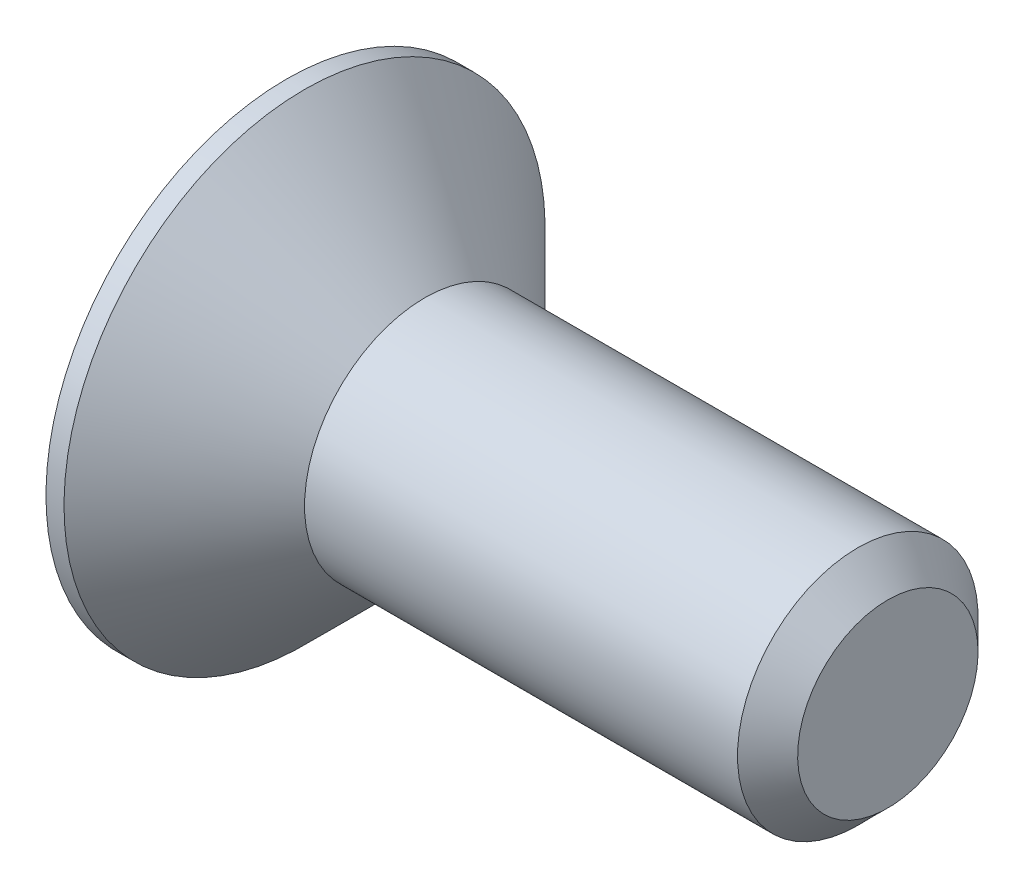
ISO-10303-21;
HEADER;
FILE_DESCRIPTION(('STEP AP214'),'2;1');
FILE_NAME('part.step','',(''),(''),'','','');
FILE_SCHEMA(('AUTOMOTIVE_DESIGN { 1 0 10303 214 1 1 1 1 }'));
ENDSEC;
DATA;
#1=APPLICATION_CONTEXT('core data for automotive mechanical design processes');
#2=APPLICATION_PROTOCOL_DEFINITION('international standard','automotive_design',2000,#1);
#3=PRODUCT_CONTEXT('',#1,'mechanical');
#4=PRODUCT('Part','Part','',(#3));
#5=PRODUCT_RELATED_PRODUCT_CATEGORY('part','',(#4));
#6=PRODUCT_DEFINITION_FORMATION('','',#4);
#7=PRODUCT_DEFINITION_CONTEXT('part definition',#1,'design');
#8=PRODUCT_DEFINITION('design','',#6,#7);
#9=PRODUCT_DEFINITION_SHAPE('','',#8);
#10=(LENGTH_UNIT() NAMED_UNIT(*) SI_UNIT(.MILLI.,.METRE.));
#11=(NAMED_UNIT(*) PLANE_ANGLE_UNIT() SI_UNIT($,.RADIAN.));
#12=(NAMED_UNIT(*) SI_UNIT($,.STERADIAN.) SOLID_ANGLE_UNIT());
#13=UNCERTAINTY_MEASURE_WITH_UNIT(LENGTH_MEASURE(1.E-05),#10,'distance_accuracy_value','');
#14=(GEOMETRIC_REPRESENTATION_CONTEXT(3) GLOBAL_UNCERTAINTY_ASSIGNED_CONTEXT((#13)) GLOBAL_UNIT_ASSIGNED_CONTEXT((#10,
#11,#12)) REPRESENTATION_CONTEXT('',''));
#15=CARTESIAN_POINT('',(0.,0.,0.));
#16=DIRECTION('',(0.,0.,1.));
#17=DIRECTION('',(1.,0.,0.));
#18=AXIS2_PLACEMENT_3D('',#15,#16,#17);
#19=CARTESIAN_POINT('',(0.,0.,0.));
#20=DIRECTION('',(-1.,0.,0.));
#21=DIRECTION('',(0.,-1.,0.));
#22=AXIS2_PLACEMENT_3D('',#19,#20,#21);
#23=PLANE('',#22);
#24=DIRECTION('',(0.,0.5,-0.866025403784439));
#25=VECTOR('',#24,1.);
#26=CARTESIAN_POINT('',(0.,0.721687836487033,1.25));
#27=LINE('',#26,#25);
#28=CARTESIAN_POINT('',(0.,0.721687836487033,1.25));
#29=VERTEX_POINT('',#28);
#30=CARTESIAN_POINT('',(0.,1.44337567297406,0.));
#31=VERTEX_POINT('',#30);
#32=EDGE_CURVE('E48',#29,#31,#27,.T.);
#33=ORIENTED_EDGE('',*,*,#32,.F.);
#34=DIRECTION('',(0.,1.,0.));
#35=VECTOR('',#34,1.);
#36=CARTESIAN_POINT('',(0.,-0.721687836487033,1.25));
#37=LINE('',#36,#35);
#38=CARTESIAN_POINT('',(0.,-0.721687836487033,1.25));
#39=VERTEX_POINT('',#38);
#40=EDGE_CURVE('E131',#39,#29,#37,.T.);
#41=ORIENTED_EDGE('',*,*,#40,.F.);
#42=DIRECTION('',(0.,0.5,0.866025403784439));
#43=VECTOR('',#42,1.);
#44=CARTESIAN_POINT('',(0.,-1.44337567297406,0.));
#45=LINE('',#44,#43);
#46=CARTESIAN_POINT('',(0.,-1.44337567297406,0.));
#47=VERTEX_POINT('',#46);
#48=EDGE_CURVE('E129',#47,#39,#45,.T.);
#49=ORIENTED_EDGE('',*,*,#48,.F.);
#50=DIRECTION('',(0.,-0.5,0.866025403784439));
#51=VECTOR('',#50,1.);
#52=CARTESIAN_POINT('',(0.,-0.721687836487032,-1.25));
#53=LINE('',#52,#51);
#54=CARTESIAN_POINT('',(0.,-0.721687836487032,-1.25));
#55=VERTEX_POINT('',#54);
#56=EDGE_CURVE('E96',#55,#47,#53,.T.);
#57=ORIENTED_EDGE('',*,*,#56,.F.);
#58=DIRECTION('',(0.,-1.,0.));
#59=VECTOR('',#58,1.);
#60=CARTESIAN_POINT('',(0.,0.721687836487033,-1.25));
#61=LINE('',#60,#59);
#62=CARTESIAN_POINT('',(0.,0.721687836487033,-1.25));
#63=VERTEX_POINT('',#62);
#64=EDGE_CURVE('E125',#63,#55,#61,.T.);
#65=ORIENTED_EDGE('',*,*,#64,.F.);
#66=DIRECTION('',(0.,-0.5,-0.866025403784439));
#67=VECTOR('',#66,1.);
#68=CARTESIAN_POINT('',(0.,1.44337567297406,0.));
#69=LINE('',#68,#67);
#70=EDGE_CURVE('E122',#31,#63,#69,.T.);
#71=ORIENTED_EDGE('',*,*,#70,.F.);
#72=EDGE_LOOP('',(#33,#41,#49,#57,#65,#71));
#73=FACE_BOUND('',#72,.T.);
#74=CARTESIAN_POINT('',(0.,0.,0.));
#75=DIRECTION('',(1.,0.,0.));
#76=DIRECTION('',(0.,1.,0.));
#77=AXIS2_PLACEMENT_3D('',#74,#75,#76);
#78=CIRCLE('',#77,4.);
#79=CARTESIAN_POINT('',(0.,4.,0.));
#80=VERTEX_POINT('',#79);
#81=EDGE_CURVE('E146',#80,#80,#78,.T.);
#82=ORIENTED_EDGE('',*,*,#81,.F.);
#83=EDGE_LOOP('',(#82));
#84=FACE_BOUND('',#83,.T.);
#85=ADVANCED_FACE('F33',(#73,#84),#23,.T.);
#86=CARTESIAN_POINT('',(10.,0.,0.));
#87=DIRECTION('',(1.,0.,0.));
#88=DIRECTION('',(0.,1.,0.));
#89=AXIS2_PLACEMENT_3D('',#86,#87,#88);
#90=CYLINDRICAL_SURFACE('',#89,4.);
#91=ORIENTED_EDGE('',*,*,#81,.T.);
#92=EDGE_LOOP('',(#91));
#93=FACE_BOUND('',#92,.T.);
#94=CARTESIAN_POINT('',(0.29999999999995,0.,0.));
#95=DIRECTION('',(1.,0.,0.));
#96=DIRECTION('',(0.,1.,0.));
#97=AXIS2_PLACEMENT_3D('',#94,#95,#96);
#98=CIRCLE('',#97,4.);
#99=CARTESIAN_POINT('',(0.299999999999951,4.,0.));
#100=VERTEX_POINT('',#99);
#101=EDGE_CURVE('E143',#100,#100,#98,.T.);
#102=ORIENTED_EDGE('',*,*,#101,.F.);
#103=EDGE_LOOP('',(#102));
#104=FACE_BOUND('',#103,.T.);
#105=ADVANCED_FACE('F166',(#93,#104),#90,.T.);
#106=CARTESIAN_POINT('',(2.3,0.,0.));
#107=DIRECTION('',(-1.,0.,0.));
#108=DIRECTION('',(0.,-1.,0.));
#109=AXIS2_PLACEMENT_3D('',#106,#107,#108);
#110=CONICAL_SURFACE('',#109,2.,0.785398163397436);
#111=ORIENTED_EDGE('',*,*,#101,.T.);
#112=EDGE_LOOP('',(#111));
#113=FACE_BOUND('',#112,.T.);
#114=CARTESIAN_POINT('',(2.3,0.,0.));
#115=DIRECTION('',(1.,0.,0.));
#116=DIRECTION('',(0.,1.,0.));
#117=AXIS2_PLACEMENT_3D('',#114,#115,#116);
#118=CIRCLE('',#117,2.);
#119=CARTESIAN_POINT('',(2.3,2.,0.));
#120=VERTEX_POINT('',#119);
#121=EDGE_CURVE('E135',#120,#120,#118,.T.);
#122=ORIENTED_EDGE('',*,*,#121,.F.);
#123=EDGE_LOOP('',(#122));
#124=FACE_BOUND('',#123,.T.);
#125=ADVANCED_FACE('F171',(#113,#124),#110,.T.);
#126=CARTESIAN_POINT('',(10.,0.,0.));
#127=DIRECTION('',(1.,0.,0.));
#128=DIRECTION('',(0.,1.,0.));
#129=AXIS2_PLACEMENT_3D('',#126,#127,#128);
#130=CYLINDRICAL_SURFACE('',#129,2.);
#131=CARTESIAN_POINT('',(9.5,0.,0.));
#132=DIRECTION('',(1.,0.,0.));
#133=DIRECTION('',(0.,1.,0.));
#134=AXIS2_PLACEMENT_3D('',#131,#132,#133);
#135=CIRCLE('',#134,2.);
#136=CARTESIAN_POINT('',(9.5,2.,0.));
#137=VERTEX_POINT('',#136);
#138=EDGE_CURVE('E11',#137,#137,#135,.F.);
#139=ORIENTED_EDGE('',*,*,#138,.T.);
#140=EDGE_LOOP('',(#139));
#141=FACE_BOUND('',#140,.T.);
#142=ORIENTED_EDGE('',*,*,#121,.T.);
#143=EDGE_LOOP('',(#142));
#144=FACE_BOUND('',#143,.T.);
#145=ADVANCED_FACE('F162',(#141,#144),#130,.T.);
#146=CARTESIAN_POINT('',(10.,2.,0.));
#147=DIRECTION('',(1.,0.,0.));
#148=DIRECTION('',(0.,1.,0.));
#149=AXIS2_PLACEMENT_3D('',#146,#147,#148);
#150=PLANE('',#149);
#151=CARTESIAN_POINT('',(10.,0.,0.));
#152=DIRECTION('',(1.,0.,0.));
#153=DIRECTION('',(0.,1.,0.));
#154=AXIS2_PLACEMENT_3D('',#151,#152,#153);
#155=CIRCLE('',#154,1.5);
#156=CARTESIAN_POINT('',(10.,1.5,0.));
#157=VERTEX_POINT('',#156);
#158=EDGE_CURVE('E41',#157,#157,#155,.T.);
#159=ORIENTED_EDGE('',*,*,#158,.T.);
#160=EDGE_LOOP('',(#159));
#161=FACE_BOUND('',#160,.T.);
#162=ADVANCED_FACE('F151',(#161),#150,.T.);
#163=CARTESIAN_POINT('',(10.,0.,0.));
#164=DIRECTION('',(-1.,0.,0.));
#165=DIRECTION('',(0.,-1.,0.));
#166=AXIS2_PLACEMENT_3D('',#163,#164,#165);
#167=CONICAL_SURFACE('',#166,1.5,0.785398163397446);
#168=ORIENTED_EDGE('',*,*,#138,.F.);
#169=EDGE_LOOP('',(#168));
#170=FACE_BOUND('',#169,.T.);
#171=ORIENTED_EDGE('',*,*,#158,.F.);
#172=EDGE_LOOP('',(#171));
#173=FACE_BOUND('',#172,.T.);
#174=ADVANCED_FACE('F35',(#170,#173),#167,.T.);
#175=CARTESIAN_POINT('',(1.8,0.721687836487032,1.25));
#176=DIRECTION('',(0.,0.866025403784438,0.5));
#177=DIRECTION('',(0.,-0.5,0.866025403784439));
#178=AXIS2_PLACEMENT_3D('',#175,#176,#177);
#179=PLANE('',#178);
#180=ORIENTED_EDGE('',*,*,#32,.T.);
#181=DIRECTION('',(-1.,0.,0.));
#182=VECTOR('',#181,1.);
#183=CARTESIAN_POINT('',(1.8,1.44337567297406,0.));
#184=LINE('',#183,#182);
#185=CARTESIAN_POINT('',(1.8,1.44337567297406,0.));
#186=VERTEX_POINT('',#185);
#187=EDGE_CURVE('E78',#186,#31,#184,.T.);
#188=ORIENTED_EDGE('',*,*,#187,.F.);
#189=DIRECTION('',(0.,0.5,-0.866025403784439));
#190=VECTOR('',#189,1.);
#191=CARTESIAN_POINT('',(1.8,0.721687836487032,1.25));
#192=LINE('',#191,#190);
#193=CARTESIAN_POINT('',(1.8,0.721687836487032,1.25));
#194=VERTEX_POINT('',#193);
#195=EDGE_CURVE('E133',#194,#186,#192,.T.);
#196=ORIENTED_EDGE('',*,*,#195,.F.);
#197=DIRECTION('',(-1.,0.,0.));
#198=VECTOR('',#197,1.);
#199=CARTESIAN_POINT('',(1.8,0.721687836487032,1.25));
#200=LINE('',#199,#198);
#201=EDGE_CURVE('E56',#194,#29,#200,.T.);
#202=ORIENTED_EDGE('',*,*,#201,.T.);
#203=EDGE_LOOP('',(#180,#188,#196,#202));
#204=FACE_BOUND('',#203,.T.);
#205=ADVANCED_FACE('F154',(#204),#179,.F.);
#206=CARTESIAN_POINT('',(1.8,-0.721687836487033,1.25));
#207=DIRECTION('',(0.,0.,1.));
#208=DIRECTION('',(0.,-1.,0.));
#209=AXIS2_PLACEMENT_3D('',#206,#207,#208);
#210=PLANE('',#209);
#211=ORIENTED_EDGE('',*,*,#40,.T.);
#212=ORIENTED_EDGE('',*,*,#201,.F.);
#213=DIRECTION('',(0.,1.,0.));
#214=VECTOR('',#213,1.);
#215=CARTESIAN_POINT('',(1.8,-0.721687836487033,1.25));
#216=LINE('',#215,#214);
#217=CARTESIAN_POINT('',(1.8,-0.721687836487033,1.25));
#218=VERTEX_POINT('',#217);
#219=EDGE_CURVE('E108',#218,#194,#216,.T.);
#220=ORIENTED_EDGE('',*,*,#219,.F.);
#221=DIRECTION('',(-1.,0.,0.));
#222=VECTOR('',#221,1.);
#223=CARTESIAN_POINT('',(1.8,-0.721687836487033,1.25));
#224=LINE('',#223,#222);
#225=EDGE_CURVE('E100',#218,#39,#224,.T.);
#226=ORIENTED_EDGE('',*,*,#225,.T.);
#227=EDGE_LOOP('',(#211,#212,#220,#226));
#228=FACE_BOUND('',#227,.T.);
#229=ADVANCED_FACE('F160',(#228),#210,.F.);
#230=CARTESIAN_POINT('',(1.8,-1.44337567297407,0.));
#231=DIRECTION('',(0.,-0.866025403784439,0.5));
#232=DIRECTION('',(0.,-0.5,-0.866025403784439));
#233=AXIS2_PLACEMENT_3D('',#230,#231,#232);
#234=PLANE('',#233);
#235=ORIENTED_EDGE('',*,*,#48,.T.);
#236=ORIENTED_EDGE('',*,*,#225,.F.);
#237=DIRECTION('',(0.,0.5,0.866025403784439));
#238=VECTOR('',#237,1.);
#239=CARTESIAN_POINT('',(1.8,-1.44337567297407,0.));
#240=LINE('',#239,#238);
#241=CARTESIAN_POINT('',(1.8,-1.44337567297407,0.));
#242=VERTEX_POINT('',#241);
#243=EDGE_CURVE('E104',#242,#218,#240,.T.);
#244=ORIENTED_EDGE('',*,*,#243,.F.);
#245=DIRECTION('',(-1.,0.,0.));
#246=VECTOR('',#245,1.);
#247=CARTESIAN_POINT('',(1.8,-1.44337567297407,0.));
#248=LINE('',#247,#246);
#249=EDGE_CURVE('E89',#242,#47,#248,.T.);
#250=ORIENTED_EDGE('',*,*,#249,.T.);
#251=EDGE_LOOP('',(#235,#236,#244,#250));
#252=FACE_BOUND('',#251,.T.);
#253=ADVANCED_FACE('F105',(#252),#234,.F.);
#254=CARTESIAN_POINT('',(1.8,-0.721687836487033,-1.25));
#255=DIRECTION('',(0.,-0.866025403784438,-0.5));
#256=DIRECTION('',(0.,0.5,-0.866025403784439));
#257=AXIS2_PLACEMENT_3D('',#254,#255,#256);
#258=PLANE('',#257);
#259=ORIENTED_EDGE('',*,*,#56,.T.);
#260=ORIENTED_EDGE('',*,*,#249,.F.);
#261=DIRECTION('',(0.,-0.5,0.866025403784439));
#262=VECTOR('',#261,1.);
#263=CARTESIAN_POINT('',(1.8,-0.721687836487033,-1.25));
#264=LINE('',#263,#262);
#265=CARTESIAN_POINT('',(1.8,-0.721687836487033,-1.25));
#266=VERTEX_POINT('',#265);
#267=EDGE_CURVE('E93',#266,#242,#264,.T.);
#268=ORIENTED_EDGE('',*,*,#267,.F.);
#269=DIRECTION('',(-1.,0.,0.));
#270=VECTOR('',#269,1.);
#271=CARTESIAN_POINT('',(1.8,-0.721687836487033,-1.25));
#272=LINE('',#271,#270);
#273=EDGE_CURVE('E101',#266,#55,#272,.T.);
#274=ORIENTED_EDGE('',*,*,#273,.T.);
#275=EDGE_LOOP('',(#259,#260,#268,#274));
#276=FACE_BOUND('',#275,.T.);
#277=ADVANCED_FACE('F91',(#276),#258,.F.);
#278=CARTESIAN_POINT('',(1.8,0.721687836487032,-1.25));
#279=DIRECTION('',(0.,0.,-1.));
#280=DIRECTION('',(-1.,0.,0.));
#281=AXIS2_PLACEMENT_3D('',#278,#279,#280);
#282=PLANE('',#281);
#283=ORIENTED_EDGE('',*,*,#64,.T.);
#284=ORIENTED_EDGE('',*,*,#273,.F.);
#285=DIRECTION('',(0.,-1.,0.));
#286=VECTOR('',#285,1.);
#287=CARTESIAN_POINT('',(1.8,0.721687836487032,-1.25));
#288=LINE('',#287,#286);
#289=CARTESIAN_POINT('',(1.8,0.721687836487032,-1.25));
#290=VERTEX_POINT('',#289);
#291=EDGE_CURVE('E114',#290,#266,#288,.T.);
#292=ORIENTED_EDGE('',*,*,#291,.F.);
#293=DIRECTION('',(-1.,0.,0.));
#294=VECTOR('',#293,1.);
#295=CARTESIAN_POINT('',(1.8,0.721687836487032,-1.25));
#296=LINE('',#295,#294);
#297=EDGE_CURVE('E138',#290,#63,#296,.T.);
#298=ORIENTED_EDGE('',*,*,#297,.T.);
#299=EDGE_LOOP('',(#283,#284,#292,#298));
#300=FACE_BOUND('',#299,.T.);
#301=ADVANCED_FACE('F185',(#300),#282,.F.);
#302=CARTESIAN_POINT('',(1.8,1.44337567297406,0.));
#303=DIRECTION('',(0.,0.866025403784439,-0.5));
#304=DIRECTION('',(0.,0.5,0.866025403784439));
#305=AXIS2_PLACEMENT_3D('',#302,#303,#304);
#306=PLANE('',#305);
#307=ORIENTED_EDGE('',*,*,#70,.T.);
#308=ORIENTED_EDGE('',*,*,#297,.F.);
#309=DIRECTION('',(0.,-0.5,-0.866025403784439));
#310=VECTOR('',#309,1.);
#311=CARTESIAN_POINT('',(1.8,1.44337567297406,0.));
#312=LINE('',#311,#310);
#313=EDGE_CURVE('E116',#186,#290,#312,.T.);
#314=ORIENTED_EDGE('',*,*,#313,.F.);
#315=ORIENTED_EDGE('',*,*,#187,.T.);
#316=EDGE_LOOP('',(#307,#308,#314,#315));
#317=FACE_BOUND('',#316,.T.);
#318=ADVANCED_FACE('F182',(#317),#306,.F.);
#319=CARTESIAN_POINT('',(1.8,0.,0.));
#320=DIRECTION('',(-1.,0.,0.));
#321=DIRECTION('',(0.,-1.,0.));
#322=AXIS2_PLACEMENT_3D('',#319,#320,#321);
#323=PLANE('',#322);
#324=ORIENTED_EDGE('',*,*,#195,.T.);
#325=ORIENTED_EDGE('',*,*,#313,.T.);
#326=ORIENTED_EDGE('',*,*,#291,.T.);
#327=ORIENTED_EDGE('',*,*,#267,.T.);
#328=ORIENTED_EDGE('',*,*,#243,.T.);
#329=ORIENTED_EDGE('',*,*,#219,.T.);
#330=EDGE_LOOP('',(#324,#325,#326,#327,#328,#329));
#331=FACE_BOUND('',#330,.T.);
#332=ADVANCED_FACE('F111',(#331),#323,.T.);
#333=CLOSED_SHELL('',(#85,#105,#125,#145,#162,#174,#205,#229,#253,#277,#301,#318,#332));
#334=MANIFOLD_SOLID_BREP('B2',#333);
#335=ADVANCED_BREP_SHAPE_REPRESENTATION('',(#18,#334),#14);
#336=SHAPE_DEFINITION_REPRESENTATION(#9,#335);
ENDSEC;
END-ISO-10303-21;
